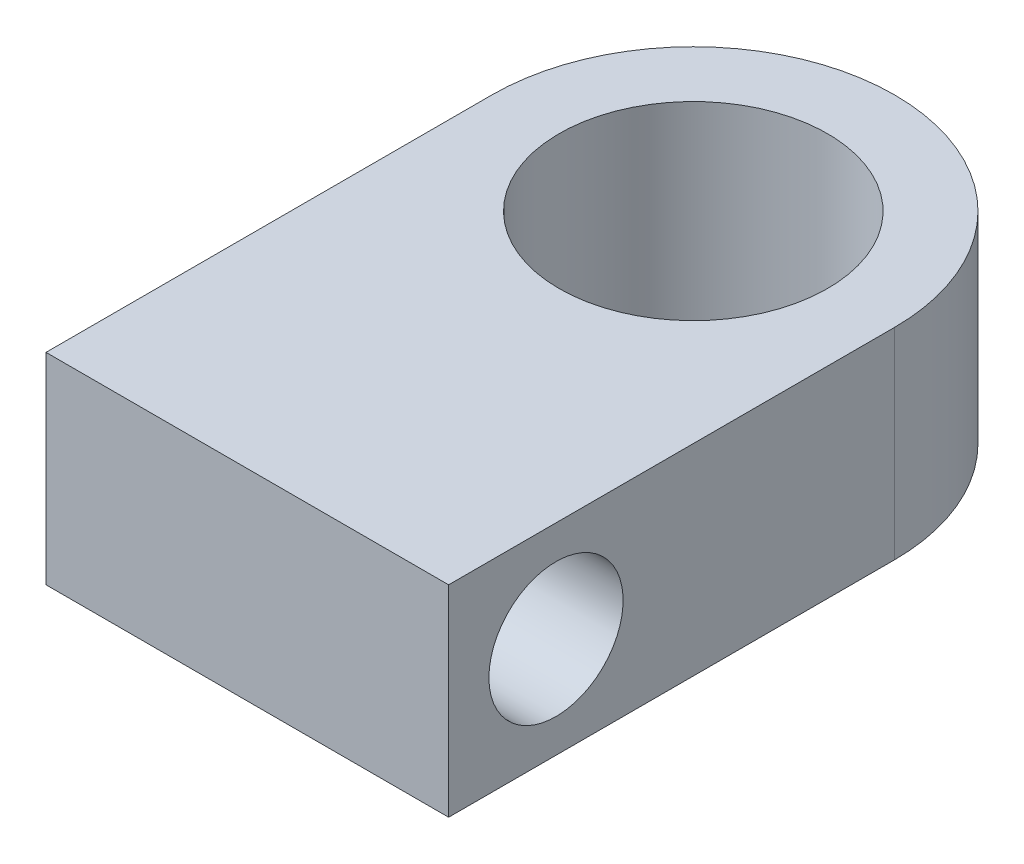
ISO-10303-21;
HEADER;
FILE_DESCRIPTION(('STEP AP214'),'2;1');
FILE_NAME('part.step','',(''),(''),'','','');
FILE_SCHEMA(('AUTOMOTIVE_DESIGN { 1 0 10303 214 1 1 1 1 }'));
ENDSEC;
DATA;
#1=APPLICATION_CONTEXT('core data for automotive mechanical design processes');
#2=APPLICATION_PROTOCOL_DEFINITION('international standard','automotive_design',2000,#1);
#3=PRODUCT_CONTEXT('',#1,'mechanical');
#4=PRODUCT('Part','Part','',(#3));
#5=PRODUCT_RELATED_PRODUCT_CATEGORY('part','',(#4));
#6=PRODUCT_DEFINITION_FORMATION('','',#4);
#7=PRODUCT_DEFINITION_CONTEXT('part definition',#1,'design');
#8=PRODUCT_DEFINITION('design','',#6,#7);
#9=PRODUCT_DEFINITION_SHAPE('','',#8);
#10=(LENGTH_UNIT() NAMED_UNIT(*) SI_UNIT(.MILLI.,.METRE.));
#11=(NAMED_UNIT(*) PLANE_ANGLE_UNIT() SI_UNIT($,.RADIAN.));
#12=(NAMED_UNIT(*) SI_UNIT($,.STERADIAN.) SOLID_ANGLE_UNIT());
#13=UNCERTAINTY_MEASURE_WITH_UNIT(LENGTH_MEASURE(1.E-05),#10,'distance_accuracy_value','');
#14=(GEOMETRIC_REPRESENTATION_CONTEXT(3) GLOBAL_UNCERTAINTY_ASSIGNED_CONTEXT((#13)) GLOBAL_UNIT_ASSIGNED_CONTEXT((#10,
#11,#12)) REPRESENTATION_CONTEXT('',''));
#15=CARTESIAN_POINT('',(0.,0.,0.));
#16=DIRECTION('',(0.,0.,1.));
#17=DIRECTION('',(1.,0.,0.));
#18=AXIS2_PLACEMENT_3D('',#15,#16,#17);
#19=CARTESIAN_POINT('',(0.,9.525,0.));
#20=DIRECTION('',(0.,1.,0.));
#21=DIRECTION('',(0.,0.,1.));
#22=AXIS2_PLACEMENT_3D('',#19,#20,#21);
#23=PLANE('',#22);
#24=CARTESIAN_POINT('',(0.,9.525,0.));
#25=DIRECTION('',(0.,1.,0.));
#26=DIRECTION('',(0.,0.,1.));
#27=AXIS2_PLACEMENT_3D('',#24,#25,#26);
#28=CIRCLE('',#27,9.525);
#29=CARTESIAN_POINT('',(9.525,9.525,0.));
#30=VERTEX_POINT('',#29);
#31=CARTESIAN_POINT('',(-9.525,9.525,0.));
#32=VERTEX_POINT('',#31);
#33=EDGE_CURVE('E11',#30,#32,#28,.T.);
#34=ORIENTED_EDGE('',*,*,#33,.T.);
#35=DIRECTION('',(0.,0.,1.));
#36=VECTOR('',#35,1.);
#37=CARTESIAN_POINT('',(-9.525,9.525,0.));
#38=LINE('',#37,#36);
#39=CARTESIAN_POINT('',(-9.525,9.525,21.1002604126301));
#40=VERTEX_POINT('',#39);
#41=EDGE_CURVE('E100',#32,#40,#38,.T.);
#42=ORIENTED_EDGE('',*,*,#41,.T.);
#43=DIRECTION('',(1.,0.,0.));
#44=VECTOR('',#43,1.);
#45=CARTESIAN_POINT('',(-9.525,9.525,21.1002604126301));
#46=LINE('',#45,#44);
#47=CARTESIAN_POINT('',(9.525,9.525,21.1002604126301));
#48=VERTEX_POINT('',#47);
#49=EDGE_CURVE('E82',#40,#48,#46,.T.);
#50=ORIENTED_EDGE('',*,*,#49,.T.);
#51=DIRECTION('',(0.,0.,-1.));
#52=VECTOR('',#51,1.);
#53=CARTESIAN_POINT('',(9.525,9.525,21.1002604126301));
#54=LINE('',#53,#52);
#55=EDGE_CURVE('E44',#48,#30,#54,.T.);
#56=ORIENTED_EDGE('',*,*,#55,.T.);
#57=EDGE_LOOP('',(#34,#42,#50,#56));
#58=FACE_BOUND('',#57,.T.);
#59=CARTESIAN_POINT('',(0.,9.525,0.));
#60=DIRECTION('',(0.,1.,0.));
#61=DIRECTION('',(0.,0.,1.));
#62=AXIS2_PLACEMENT_3D('',#59,#60,#61);
#63=CIRCLE('',#62,6.35);
#64=CARTESIAN_POINT('',(0.,9.525,6.35));
#65=VERTEX_POINT('',#64);
#66=EDGE_CURVE('E109',#65,#65,#63,.T.);
#67=ORIENTED_EDGE('',*,*,#66,.F.);
#68=EDGE_LOOP('',(#67));
#69=FACE_BOUND('',#68,.T.);
#70=ADVANCED_FACE('F30',(#58,#69),#23,.T.);
#71=CARTESIAN_POINT('',(0.,0.,0.));
#72=DIRECTION('',(0.,1.,0.));
#73=DIRECTION('',(0.,0.,1.));
#74=AXIS2_PLACEMENT_3D('',#71,#72,#73);
#75=PLANE('',#74);
#76=CARTESIAN_POINT('',(0.,0.,0.));
#77=DIRECTION('',(0.,1.,0.));
#78=DIRECTION('',(0.,0.,1.));
#79=AXIS2_PLACEMENT_3D('',#76,#77,#78);
#80=CIRCLE('',#79,9.525);
#81=CARTESIAN_POINT('',(9.525,0.,0.));
#82=VERTEX_POINT('',#81);
#83=CARTESIAN_POINT('',(-9.525,0.,0.));
#84=VERTEX_POINT('',#83);
#85=EDGE_CURVE('E34',#82,#84,#80,.T.);
#86=ORIENTED_EDGE('',*,*,#85,.F.);
#87=DIRECTION('',(0.,0.,-1.));
#88=VECTOR('',#87,1.);
#89=CARTESIAN_POINT('',(9.525,0.,21.1002604126301));
#90=LINE('',#89,#88);
#91=CARTESIAN_POINT('',(9.525,0.,21.1002604126301));
#92=VERTEX_POINT('',#91);
#93=EDGE_CURVE('E52',#92,#82,#90,.T.);
#94=ORIENTED_EDGE('',*,*,#93,.F.);
#95=DIRECTION('',(1.,0.,0.));
#96=VECTOR('',#95,1.);
#97=CARTESIAN_POINT('',(-9.525,0.,21.1002604126301));
#98=LINE('',#97,#96);
#99=CARTESIAN_POINT('',(-9.525,0.,21.1002604126301));
#100=VERTEX_POINT('',#99);
#101=EDGE_CURVE('E81',#100,#92,#98,.T.);
#102=ORIENTED_EDGE('',*,*,#101,.F.);
#103=DIRECTION('',(0.,0.,1.));
#104=VECTOR('',#103,1.);
#105=CARTESIAN_POINT('',(-9.525,0.,0.));
#106=LINE('',#105,#104);
#107=EDGE_CURVE('E89',#84,#100,#106,.T.);
#108=ORIENTED_EDGE('',*,*,#107,.F.);
#109=EDGE_LOOP('',(#86,#94,#102,#108));
#110=FACE_BOUND('',#109,.T.);
#111=CARTESIAN_POINT('',(0.,0.,0.));
#112=DIRECTION('',(0.,1.,0.));
#113=DIRECTION('',(0.,0.,1.));
#114=AXIS2_PLACEMENT_3D('',#111,#112,#113);
#115=CIRCLE('',#114,6.35);
#116=CARTESIAN_POINT('',(0.,0.,6.35));
#117=VERTEX_POINT('',#116);
#118=EDGE_CURVE('E106',#117,#117,#115,.T.);
#119=ORIENTED_EDGE('',*,*,#118,.T.);
#120=EDGE_LOOP('',(#119));
#121=FACE_BOUND('',#120,.T.);
#122=ADVANCED_FACE('F87',(#110,#121),#75,.F.);
#123=CARTESIAN_POINT('',(0.,9.525,0.));
#124=DIRECTION('',(0.,-1.,0.));
#125=DIRECTION('',(0.,0.,-1.));
#126=AXIS2_PLACEMENT_3D('',#123,#124,#125);
#127=CYLINDRICAL_SURFACE('',#126,9.525);
#128=ORIENTED_EDGE('',*,*,#33,.F.);
#129=DIRECTION('',(0.,1.,0.));
#130=VECTOR('',#129,1.);
#131=CARTESIAN_POINT('',(9.525,0.,0.));
#132=LINE('',#131,#130);
#133=EDGE_CURVE('E104',#82,#30,#132,.T.);
#134=ORIENTED_EDGE('',*,*,#133,.F.);
#135=ORIENTED_EDGE('',*,*,#85,.T.);
#136=DIRECTION('',(0.,1.,0.));
#137=VECTOR('',#136,1.);
#138=CARTESIAN_POINT('',(-9.525,0.,0.));
#139=LINE('',#138,#137);
#140=EDGE_CURVE('E75',#84,#32,#139,.T.);
#141=ORIENTED_EDGE('',*,*,#140,.T.);
#142=EDGE_LOOP('',(#128,#134,#135,#141));
#143=FACE_BOUND('',#142,.T.);
#144=ADVANCED_FACE('F32',(#143),#127,.T.);
#145=CARTESIAN_POINT('',(0.,9.525,0.));
#146=DIRECTION('',(0.,-1.,0.));
#147=DIRECTION('',(0.,0.,-1.));
#148=AXIS2_PLACEMENT_3D('',#145,#146,#147);
#149=CYLINDRICAL_SURFACE('',#148,6.35);
#150=ORIENTED_EDGE('',*,*,#66,.T.);
#151=EDGE_LOOP('',(#150));
#152=FACE_BOUND('',#151,.T.);
#153=ORIENTED_EDGE('',*,*,#118,.F.);
#154=EDGE_LOOP('',(#153));
#155=FACE_BOUND('',#154,.T.);
#156=ADVANCED_FACE('F115',(#152,#155),#149,.F.);
#157=CARTESIAN_POINT('',(9.525,0.,21.1002604126301));
#158=DIRECTION('',(1.,0.,0.));
#159=DIRECTION('',(0.,0.,-1.));
#160=AXIS2_PLACEMENT_3D('',#157,#158,#159);
#161=PLANE('',#160);
#162=CARTESIAN_POINT('',(9.525,4.7625,16.0202604126301));
#163=DIRECTION('',(-1.,0.,0.));
#164=DIRECTION('',(0.,0.,1.));
#165=AXIS2_PLACEMENT_3D('',#162,#163,#164);
#166=CIRCLE('',#165,3.175);
#167=CARTESIAN_POINT('',(9.525,4.7625,19.1952604126301));
#168=VERTEX_POINT('',#167);
#169=EDGE_CURVE('E102',#168,#168,#166,.T.);
#170=ORIENTED_EDGE('',*,*,#169,.T.);
#171=EDGE_LOOP('',(#170));
#172=FACE_BOUND('',#171,.T.);
#173=ORIENTED_EDGE('',*,*,#55,.F.);
#174=DIRECTION('',(0.,1.,0.));
#175=VECTOR('',#174,1.);
#176=CARTESIAN_POINT('',(9.525,0.,21.1002604126301));
#177=LINE('',#176,#175);
#178=EDGE_CURVE('E69',#92,#48,#177,.T.);
#179=ORIENTED_EDGE('',*,*,#178,.F.);
#180=ORIENTED_EDGE('',*,*,#93,.T.);
#181=ORIENTED_EDGE('',*,*,#133,.T.);
#182=EDGE_LOOP('',(#173,#179,#180,#181));
#183=FACE_BOUND('',#182,.T.);
#184=ADVANCED_FACE('F117',(#172,#183),#161,.T.);
#185=CARTESIAN_POINT('',(-9.525,0.,21.1002604126301));
#186=DIRECTION('',(0.,0.,1.));
#187=DIRECTION('',(1.,0.,0.));
#188=AXIS2_PLACEMENT_3D('',#185,#186,#187);
#189=PLANE('',#188);
#190=ORIENTED_EDGE('',*,*,#49,.F.);
#191=DIRECTION('',(0.,1.,0.));
#192=VECTOR('',#191,1.);
#193=CARTESIAN_POINT('',(-9.525,0.,21.1002604126301));
#194=LINE('',#193,#192);
#195=EDGE_CURVE('E78',#100,#40,#194,.T.);
#196=ORIENTED_EDGE('',*,*,#195,.F.);
#197=ORIENTED_EDGE('',*,*,#101,.T.);
#198=ORIENTED_EDGE('',*,*,#178,.T.);
#199=EDGE_LOOP('',(#190,#196,#197,#198));
#200=FACE_BOUND('',#199,.T.);
#201=ADVANCED_FACE('F80',(#200),#189,.T.);
#202=CARTESIAN_POINT('',(-9.525,0.,0.));
#203=DIRECTION('',(-1.,0.,0.));
#204=DIRECTION('',(0.,0.,1.));
#205=AXIS2_PLACEMENT_3D('',#202,#203,#204);
#206=PLANE('',#205);
#207=CARTESIAN_POINT('',(-9.525,4.7625,16.0202604126301));
#208=DIRECTION('',(-1.,0.,0.));
#209=DIRECTION('',(0.,0.,1.));
#210=AXIS2_PLACEMENT_3D('',#207,#208,#209);
#211=CIRCLE('',#210,3.175);
#212=CARTESIAN_POINT('',(-9.525,4.7625,19.1952604126301));
#213=VERTEX_POINT('',#212);
#214=EDGE_CURVE('E96',#213,#213,#211,.T.);
#215=ORIENTED_EDGE('',*,*,#214,.F.);
#216=EDGE_LOOP('',(#215));
#217=FACE_BOUND('',#216,.T.);
#218=ORIENTED_EDGE('',*,*,#41,.F.);
#219=ORIENTED_EDGE('',*,*,#140,.F.);
#220=ORIENTED_EDGE('',*,*,#107,.T.);
#221=ORIENTED_EDGE('',*,*,#195,.T.);
#222=EDGE_LOOP('',(#218,#219,#220,#221));
#223=FACE_BOUND('',#222,.T.);
#224=ADVANCED_FACE('F92',(#217,#223),#206,.T.);
#225=CARTESIAN_POINT('',(9.525,4.7625,16.0202604126301));
#226=DIRECTION('',(-1.,0.,0.));
#227=DIRECTION('',(0.,0.,1.));
#228=AXIS2_PLACEMENT_3D('',#225,#226,#227);
#229=CYLINDRICAL_SURFACE('',#228,3.175);
#230=ORIENTED_EDGE('',*,*,#169,.F.);
#231=EDGE_LOOP('',(#230));
#232=FACE_BOUND('',#231,.T.);
#233=ORIENTED_EDGE('',*,*,#214,.T.);
#234=EDGE_LOOP('',(#233));
#235=FACE_BOUND('',#234,.T.);
#236=ADVANCED_FACE('F167',(#232,#235),#229,.F.);
#237=CLOSED_SHELL('',(#70,#122,#144,#156,#184,#201,#224,#236));
#238=MANIFOLD_SOLID_BREP('B2',#237);
#239=ADVANCED_BREP_SHAPE_REPRESENTATION('',(#18,#238),#14);
#240=SHAPE_DEFINITION_REPRESENTATION(#9,#239);
ENDSEC;
END-ISO-10303-21;
